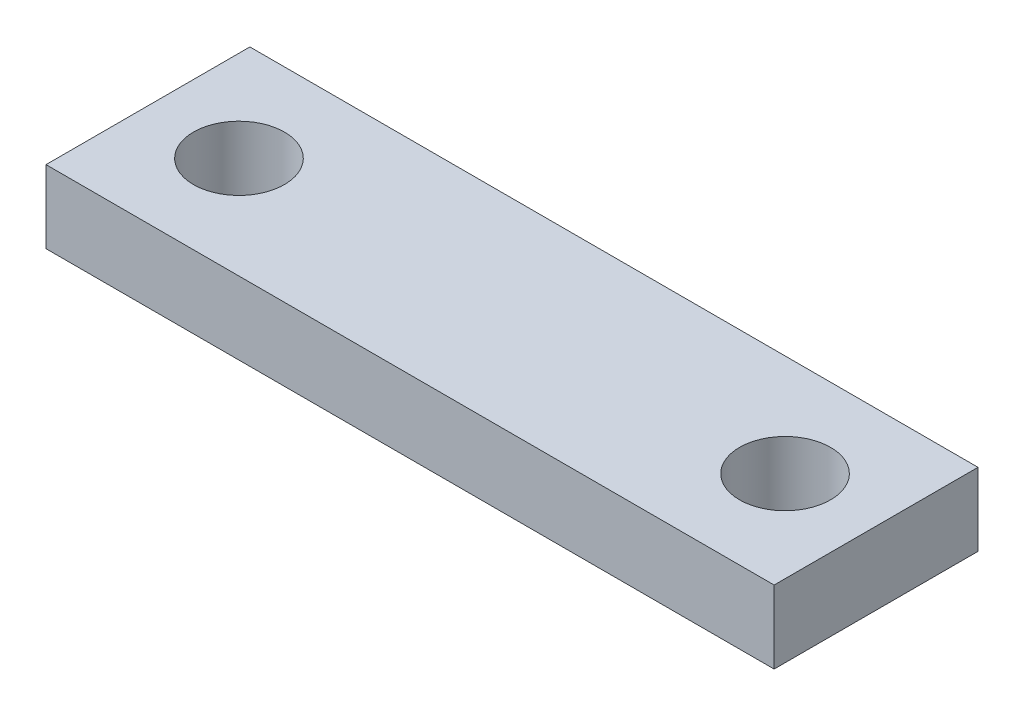
ISO-10303-21;
HEADER;
FILE_DESCRIPTION(('STEP AP214'),'2;1');
FILE_NAME('part.step','',(''),(''),'','','');
FILE_SCHEMA(('AUTOMOTIVE_DESIGN { 1 0 10303 214 1 1 1 1 }'));
ENDSEC;
DATA;
#1=APPLICATION_CONTEXT('core data for automotive mechanical design processes');
#2=APPLICATION_PROTOCOL_DEFINITION('international standard','automotive_design',2000,#1);
#3=PRODUCT_CONTEXT('',#1,'mechanical');
#4=PRODUCT('Part','Part','',(#3));
#5=PRODUCT_RELATED_PRODUCT_CATEGORY('part','',(#4));
#6=PRODUCT_DEFINITION_FORMATION('','',#4);
#7=PRODUCT_DEFINITION_CONTEXT('part definition',#1,'design');
#8=PRODUCT_DEFINITION('design','',#6,#7);
#9=PRODUCT_DEFINITION_SHAPE('','',#8);
#10=(LENGTH_UNIT() NAMED_UNIT(*) SI_UNIT(.MILLI.,.METRE.));
#11=(NAMED_UNIT(*) PLANE_ANGLE_UNIT() SI_UNIT($,.RADIAN.));
#12=(NAMED_UNIT(*) SI_UNIT($,.STERADIAN.) SOLID_ANGLE_UNIT());
#13=UNCERTAINTY_MEASURE_WITH_UNIT(LENGTH_MEASURE(1.E-05),#10,'distance_accuracy_value','');
#14=(GEOMETRIC_REPRESENTATION_CONTEXT(3) GLOBAL_UNCERTAINTY_ASSIGNED_CONTEXT((#13)) GLOBAL_UNIT_ASSIGNED_CONTEXT((#10,
#11,#12)) REPRESENTATION_CONTEXT('',''));
#15=CARTESIAN_POINT('',(0.,0.,0.));
#16=DIRECTION('',(0.,0.,1.));
#17=DIRECTION('',(1.,0.,0.));
#18=AXIS2_PLACEMENT_3D('',#15,#16,#17);
#19=CARTESIAN_POINT('',(0.,4.,0.));
#20=DIRECTION('',(0.,-1.,0.));
#21=DIRECTION('',(0.,0.,-1.));
#22=AXIS2_PLACEMENT_3D('',#19,#20,#21);
#23=PLANE('',#22);
#24=DIRECTION('',(0.,0.,-1.));
#25=VECTOR('',#24,1.);
#26=CARTESIAN_POINT('',(19.9999999999999,4.,5.59999999999999));
#27=LINE('',#26,#25);
#28=CARTESIAN_POINT('',(19.9999999999999,4.,5.59999999999999));
#29=VERTEX_POINT('',#28);
#30=CARTESIAN_POINT('',(19.9999999999999,4.,-5.59999999999999));
#31=VERTEX_POINT('',#30);
#32=EDGE_CURVE('E92',#29,#31,#27,.T.);
#33=ORIENTED_EDGE('',*,*,#32,.T.);
#34=DIRECTION('',(-1.,0.,0.));
#35=VECTOR('',#34,1.);
#36=CARTESIAN_POINT('',(-20.0000000000001,4.,-5.59999999999999));
#37=LINE('',#36,#35);
#38=CARTESIAN_POINT('',(-20.0000000000001,4.,-5.59999999999999));
#39=VERTEX_POINT('',#38);
#40=EDGE_CURVE('E87',#31,#39,#37,.T.);
#41=ORIENTED_EDGE('',*,*,#40,.T.);
#42=DIRECTION('',(0.,0.,1.));
#43=VECTOR('',#42,1.);
#44=CARTESIAN_POINT('',(-20.0000000000001,4.,5.59999999999999));
#45=LINE('',#44,#43);
#46=CARTESIAN_POINT('',(-20.0000000000001,4.,5.59999999999999));
#47=VERTEX_POINT('',#46);
#48=EDGE_CURVE('E90',#39,#47,#45,.T.);
#49=ORIENTED_EDGE('',*,*,#48,.T.);
#50=DIRECTION('',(1.,0.,0.));
#51=VECTOR('',#50,1.);
#52=CARTESIAN_POINT('',(-20.0000000000001,4.,5.59999999999999));
#53=LINE('',#52,#51);
#54=EDGE_CURVE('E57',#47,#29,#53,.T.);
#55=ORIENTED_EDGE('',*,*,#54,.T.);
#56=EDGE_LOOP('',(#33,#41,#49,#55));
#57=FACE_BOUND('',#56,.T.);
#58=CARTESIAN_POINT('',(-15.,4.,0.));
#59=DIRECTION('',(0.,1.,0.));
#60=DIRECTION('',(0.,0.,1.));
#61=AXIS2_PLACEMENT_3D('',#58,#59,#60);
#62=CIRCLE('',#61,2.5);
#63=CARTESIAN_POINT('',(-15.,4.,2.5));
#64=VERTEX_POINT('',#63);
#65=EDGE_CURVE('E112',#64,#64,#62,.T.);
#66=ORIENTED_EDGE('',*,*,#65,.F.);
#67=EDGE_LOOP('',(#66));
#68=FACE_BOUND('',#67,.T.);
#69=CARTESIAN_POINT('',(15.,4.,0.));
#70=DIRECTION('',(0.,1.,0.));
#71=DIRECTION('',(0.,0.,1.));
#72=AXIS2_PLACEMENT_3D('',#69,#70,#71);
#73=CIRCLE('',#72,2.5);
#74=CARTESIAN_POINT('',(15.,4.,2.5));
#75=VERTEX_POINT('',#74);
#76=EDGE_CURVE('E134',#75,#75,#73,.T.);
#77=ORIENTED_EDGE('',*,*,#76,.F.);
#78=EDGE_LOOP('',(#77));
#79=FACE_BOUND('',#78,.T.);
#80=ADVANCED_FACE('F39',(#57,#68,#79),#23,.F.);
#81=CARTESIAN_POINT('',(0.,0.,0.));
#82=DIRECTION('',(0.,-1.,0.));
#83=DIRECTION('',(0.,0.,-1.));
#84=AXIS2_PLACEMENT_3D('',#81,#82,#83);
#85=PLANE('',#84);
#86=CARTESIAN_POINT('',(-15.,0.,0.));
#87=DIRECTION('',(0.,1.,0.));
#88=DIRECTION('',(0.,0.,1.));
#89=AXIS2_PLACEMENT_3D('',#86,#87,#88);
#90=CIRCLE('',#89,2.5);
#91=CARTESIAN_POINT('',(-15.,0.,2.5));
#92=VERTEX_POINT('',#91);
#93=EDGE_CURVE('E130',#92,#92,#90,.T.);
#94=ORIENTED_EDGE('',*,*,#93,.T.);
#95=EDGE_LOOP('',(#94));
#96=FACE_BOUND('',#95,.T.);
#97=DIRECTION('',(0.,0.,-1.));
#98=VECTOR('',#97,1.);
#99=CARTESIAN_POINT('',(19.9999999999999,0.,5.59999999999999));
#100=LINE('',#99,#98);
#101=CARTESIAN_POINT('',(19.9999999999999,0.,5.59999999999999));
#102=VERTEX_POINT('',#101);
#103=CARTESIAN_POINT('',(19.9999999999999,0.,-5.59999999999999));
#104=VERTEX_POINT('',#103);
#105=EDGE_CURVE('E108',#102,#104,#100,.T.);
#106=ORIENTED_EDGE('',*,*,#105,.F.);
#107=DIRECTION('',(1.,0.,0.));
#108=VECTOR('',#107,1.);
#109=CARTESIAN_POINT('',(-20.0000000000001,0.,5.59999999999999));
#110=LINE('',#109,#108);
#111=CARTESIAN_POINT('',(-20.0000000000001,0.,5.59999999999999));
#112=VERTEX_POINT('',#111);
#113=EDGE_CURVE('E80',#112,#102,#110,.T.);
#114=ORIENTED_EDGE('',*,*,#113,.F.);
#115=DIRECTION('',(0.,0.,1.));
#116=VECTOR('',#115,1.);
#117=CARTESIAN_POINT('',(-20.0000000000001,0.,5.59999999999999));
#118=LINE('',#117,#116);
#119=CARTESIAN_POINT('',(-20.0000000000001,0.,-5.59999999999999));
#120=VERTEX_POINT('',#119);
#121=EDGE_CURVE('E74',#120,#112,#118,.T.);
#122=ORIENTED_EDGE('',*,*,#121,.F.);
#123=DIRECTION('',(-1.,0.,0.));
#124=VECTOR('',#123,1.);
#125=CARTESIAN_POINT('',(-20.0000000000001,0.,-5.59999999999999));
#126=LINE('',#125,#124);
#127=EDGE_CURVE('E97',#104,#120,#126,.T.);
#128=ORIENTED_EDGE('',*,*,#127,.F.);
#129=EDGE_LOOP('',(#106,#114,#122,#128));
#130=FACE_BOUND('',#129,.T.);
#131=CARTESIAN_POINT('',(15.,0.,0.));
#132=DIRECTION('',(0.,1.,0.));
#133=DIRECTION('',(0.,0.,1.));
#134=AXIS2_PLACEMENT_3D('',#131,#132,#133);
#135=CIRCLE('',#134,2.5);
#136=CARTESIAN_POINT('',(15.,0.,2.5));
#137=VERTEX_POINT('',#136);
#138=EDGE_CURVE('E138',#137,#137,#135,.T.);
#139=ORIENTED_EDGE('',*,*,#138,.T.);
#140=EDGE_LOOP('',(#139));
#141=FACE_BOUND('',#140,.T.);
#142=ADVANCED_FACE('F125',(#96,#130,#141),#85,.T.);
#143=CARTESIAN_POINT('',(19.9999999999999,4.,5.59999999999999));
#144=DIRECTION('',(-1.,0.,0.));
#145=DIRECTION('',(0.,0.,1.));
#146=AXIS2_PLACEMENT_3D('',#143,#144,#145);
#147=PLANE('',#146);
#148=ORIENTED_EDGE('',*,*,#105,.T.);
#149=DIRECTION('',(0.,-1.,0.));
#150=VECTOR('',#149,1.);
#151=CARTESIAN_POINT('',(19.9999999999999,4.,-5.59999999999999));
#152=LINE('',#151,#150);
#153=EDGE_CURVE('E11',#31,#104,#152,.T.);
#154=ORIENTED_EDGE('',*,*,#153,.F.);
#155=ORIENTED_EDGE('',*,*,#32,.F.);
#156=DIRECTION('',(0.,-1.,0.));
#157=VECTOR('',#156,1.);
#158=CARTESIAN_POINT('',(19.9999999999999,4.,5.59999999999999));
#159=LINE('',#158,#157);
#160=EDGE_CURVE('E104',#29,#102,#159,.T.);
#161=ORIENTED_EDGE('',*,*,#160,.T.);
#162=EDGE_LOOP('',(#148,#154,#155,#161));
#163=FACE_BOUND('',#162,.T.);
#164=ADVANCED_FACE('F41',(#163),#147,.F.);
#165=CARTESIAN_POINT('',(-20.0000000000001,4.,-5.59999999999999));
#166=DIRECTION('',(0.,0.,1.));
#167=DIRECTION('',(1.,0.,0.));
#168=AXIS2_PLACEMENT_3D('',#165,#166,#167);
#169=PLANE('',#168);
#170=ORIENTED_EDGE('',*,*,#127,.T.);
#171=DIRECTION('',(0.,-1.,0.));
#172=VECTOR('',#171,1.);
#173=CARTESIAN_POINT('',(-20.0000000000001,4.,-5.59999999999999));
#174=LINE('',#173,#172);
#175=EDGE_CURVE('E49',#39,#120,#174,.T.);
#176=ORIENTED_EDGE('',*,*,#175,.F.);
#177=ORIENTED_EDGE('',*,*,#40,.F.);
#178=ORIENTED_EDGE('',*,*,#153,.T.);
#179=EDGE_LOOP('',(#170,#176,#177,#178));
#180=FACE_BOUND('',#179,.T.);
#181=ADVANCED_FACE('F96',(#180),#169,.F.);
#182=CARTESIAN_POINT('',(-20.0000000000001,4.,5.59999999999999));
#183=DIRECTION('',(1.,0.,0.));
#184=DIRECTION('',(0.,0.,-1.));
#185=AXIS2_PLACEMENT_3D('',#182,#183,#184);
#186=PLANE('',#185);
#187=ORIENTED_EDGE('',*,*,#121,.T.);
#188=DIRECTION('',(0.,-1.,0.));
#189=VECTOR('',#188,1.);
#190=CARTESIAN_POINT('',(-20.0000000000001,4.,5.59999999999999));
#191=LINE('',#190,#189);
#192=EDGE_CURVE('E99',#47,#112,#191,.T.);
#193=ORIENTED_EDGE('',*,*,#192,.F.);
#194=ORIENTED_EDGE('',*,*,#48,.F.);
#195=ORIENTED_EDGE('',*,*,#175,.T.);
#196=EDGE_LOOP('',(#187,#193,#194,#195));
#197=FACE_BOUND('',#196,.T.);
#198=ADVANCED_FACE('F100',(#197),#186,.F.);
#199=CARTESIAN_POINT('',(-20.0000000000001,4.,5.59999999999999));
#200=DIRECTION('',(0.,0.,-1.));
#201=DIRECTION('',(-1.,0.,0.));
#202=AXIS2_PLACEMENT_3D('',#199,#200,#201);
#203=PLANE('',#202);
#204=ORIENTED_EDGE('',*,*,#113,.T.);
#205=ORIENTED_EDGE('',*,*,#160,.F.);
#206=ORIENTED_EDGE('',*,*,#54,.F.);
#207=ORIENTED_EDGE('',*,*,#192,.T.);
#208=EDGE_LOOP('',(#204,#205,#206,#207));
#209=FACE_BOUND('',#208,.T.);
#210=ADVANCED_FACE('F122',(#209),#203,.F.);
#211=CARTESIAN_POINT('',(-15.,4.,0.));
#212=DIRECTION('',(0.,-1.,0.));
#213=DIRECTION('',(0.,0.,-1.));
#214=AXIS2_PLACEMENT_3D('',#211,#212,#213);
#215=CYLINDRICAL_SURFACE('',#214,2.5);
#216=ORIENTED_EDGE('',*,*,#65,.T.);
#217=EDGE_LOOP('',(#216));
#218=FACE_BOUND('',#217,.T.);
#219=ORIENTED_EDGE('',*,*,#93,.F.);
#220=EDGE_LOOP('',(#219));
#221=FACE_BOUND('',#220,.T.);
#222=ADVANCED_FACE('F157',(#218,#221),#215,.F.);
#223=CARTESIAN_POINT('',(15.,4.,0.));
#224=DIRECTION('',(0.,-1.,0.));
#225=DIRECTION('',(0.,0.,-1.));
#226=AXIS2_PLACEMENT_3D('',#223,#224,#225);
#227=CYLINDRICAL_SURFACE('',#226,2.5);
#228=ORIENTED_EDGE('',*,*,#76,.T.);
#229=EDGE_LOOP('',(#228));
#230=FACE_BOUND('',#229,.T.);
#231=ORIENTED_EDGE('',*,*,#138,.F.);
#232=EDGE_LOOP('',(#231));
#233=FACE_BOUND('',#232,.T.);
#234=ADVANCED_FACE('F146',(#230,#233),#227,.F.);
#235=CLOSED_SHELL('',(#80,#142,#164,#181,#198,#210,#222,#234));
#236=MANIFOLD_SOLID_BREP('B2',#235);
#237=ADVANCED_BREP_SHAPE_REPRESENTATION('',(#18,#236),#14);
#238=SHAPE_DEFINITION_REPRESENTATION(#9,#237);
ENDSEC;
END-ISO-10303-21;
